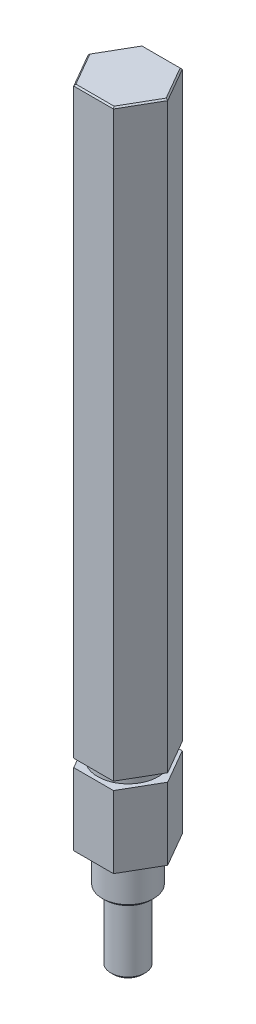
ISO-10303-21;
HEADER;
FILE_DESCRIPTION(('STEP AP214'),'2;1');
FILE_NAME('part.step','',(''),(''),'','','');
FILE_SCHEMA(('AUTOMOTIVE_DESIGN { 1 0 10303 214 1 1 1 1 }'));
ENDSEC;
DATA;
#1=APPLICATION_CONTEXT('core data for automotive mechanical design processes');
#2=APPLICATION_PROTOCOL_DEFINITION('international standard','automotive_design',2000,#1);
#3=PRODUCT_CONTEXT('',#1,'mechanical');
#4=PRODUCT('Part','Part','',(#3));
#5=PRODUCT_RELATED_PRODUCT_CATEGORY('part','',(#4));
#6=PRODUCT_DEFINITION_FORMATION('','',#4);
#7=PRODUCT_DEFINITION_CONTEXT('part definition',#1,'design');
#8=PRODUCT_DEFINITION('design','',#6,#7);
#9=PRODUCT_DEFINITION_SHAPE('','',#8);
#10=(LENGTH_UNIT() NAMED_UNIT(*) SI_UNIT(.MILLI.,.METRE.));
#11=(NAMED_UNIT(*) PLANE_ANGLE_UNIT() SI_UNIT($,.RADIAN.));
#12=(NAMED_UNIT(*) SI_UNIT($,.STERADIAN.) SOLID_ANGLE_UNIT());
#13=UNCERTAINTY_MEASURE_WITH_UNIT(LENGTH_MEASURE(1.E-05),#10,'distance_accuracy_value','');
#14=(GEOMETRIC_REPRESENTATION_CONTEXT(3) GLOBAL_UNCERTAINTY_ASSIGNED_CONTEXT((#13)) GLOBAL_UNIT_ASSIGNED_CONTEXT((#10,
#11,#12)) REPRESENTATION_CONTEXT('',''));
#15=CARTESIAN_POINT('',(0.,0.,0.));
#16=DIRECTION('',(0.,0.,1.));
#17=DIRECTION('',(1.,0.,0.));
#18=AXIS2_PLACEMENT_3D('',#15,#16,#17);
#19=CARTESIAN_POINT('',(-38.3071337161431,-45.212,-16.669011646302));
#20=DIRECTION('',(0.,1.,0.));
#21=DIRECTION('',(0.,0.,1.));
#22=AXIS2_PLACEMENT_3D('',#19,#20,#21);
#23=PLANE('',#22);
#24=CARTESIAN_POINT('',(-38.3071337161431,-45.2119999999923,-16.669011646302));
#25=DIRECTION('',(0.,1.,0.));
#26=DIRECTION('',(0.,0.,1.));
#27=AXIS2_PLACEMENT_3D('',#24,#25,#26);
#28=CIRCLE('',#27,2.65430000009029);
#29=CARTESIAN_POINT('',(-38.3071337161431,-45.2119999999923,-14.0147116462117));
#30=VERTEX_POINT('',#29);
#31=EDGE_CURVE('E21',#30,#30,#28,.T.);
#32=ORIENTED_EDGE('',*,*,#31,.F.);
#33=EDGE_LOOP('',(#32));
#34=FACE_BOUND('',#33,.T.);
#35=ADVANCED_FACE('F18',(#34),#23,.F.);
#36=CARTESIAN_POINT('',(-38.3071337161431,-44.704000000138,-16.669011646302));
#37=DIRECTION('',(0.,1.,0.));
#38=DIRECTION('',(0.,0.,1.));
#39=AXIS2_PLACEMENT_3D('',#36,#37,#38);
#40=CONICAL_SURFACE('',#39,3.16229999994458,0.785398163397448);
#41=CARTESIAN_POINT('',(-38.3071337161431,-44.704,-16.669011646302));
#42=DIRECTION('',(0.,1.,0.));
#43=DIRECTION('',(0.,0.,1.));
#44=AXIS2_PLACEMENT_3D('',#41,#42,#43);
#45=CIRCLE('',#44,3.1623);
#46=CARTESIAN_POINT('',(-38.3071337161431,-44.704,-13.506711646302));
#47=VERTEX_POINT('',#46);
#48=EDGE_CURVE('E155',#47,#47,#45,.T.);
#49=ORIENTED_EDGE('',*,*,#48,.F.);
#50=EDGE_LOOP('',(#49));
#51=FACE_BOUND('',#50,.T.);
#52=ORIENTED_EDGE('',*,*,#31,.T.);
#53=EDGE_LOOP('',(#52));
#54=FACE_BOUND('',#53,.T.);
#55=ADVANCED_FACE('F191',(#51,#54),#40,.T.);
#56=CARTESIAN_POINT('',(-38.3071337161431,-45.212,-16.669011646302));
#57=DIRECTION('',(0.,1.,0.));
#58=DIRECTION('',(0.,0.,1.));
#59=AXIS2_PLACEMENT_3D('',#56,#57,#58);
#60=CYLINDRICAL_SURFACE('',#59,3.1623);
#61=CARTESIAN_POINT('',(-38.3071337161431,-32.512,-16.669011646302));
#62=DIRECTION('',(0.,1.,0.));
#63=DIRECTION('',(0.,0.,1.));
#64=AXIS2_PLACEMENT_3D('',#61,#62,#63);
#65=CIRCLE('',#64,3.1623);
#66=CARTESIAN_POINT('',(-38.3071337161431,-32.512,-13.506711646302));
#67=VERTEX_POINT('',#66);
#68=EDGE_CURVE('E158',#67,#67,#65,.F.);
#69=ORIENTED_EDGE('',*,*,#68,.T.);
#70=EDGE_LOOP('',(#69));
#71=FACE_BOUND('',#70,.T.);
#72=ORIENTED_EDGE('',*,*,#48,.T.);
#73=EDGE_LOOP('',(#72));
#74=FACE_BOUND('',#73,.T.);
#75=ADVANCED_FACE('F175',(#71,#74),#60,.T.);
#76=CARTESIAN_POINT('',(-38.3071337161431,-32.512,-16.669011646302));
#77=DIRECTION('',(0.,1.,0.));
#78=DIRECTION('',(0.,0.,1.));
#79=AXIS2_PLACEMENT_3D('',#76,#77,#78);
#80=PLANE('',#79);
#81=CARTESIAN_POINT('',(-38.3071337161431,-32.511999999997,-16.669011646302));
#82=DIRECTION('',(0.,1.,0.));
#83=DIRECTION('',(0.,0.,1.));
#84=AXIS2_PLACEMENT_3D('',#81,#82,#83);
#85=CIRCLE('',#84,4.24179999994759);
#86=CARTESIAN_POINT('',(-38.3071337161431,-32.511999999997,-12.4272116463544));
#87=VERTEX_POINT('',#86);
#88=EDGE_CURVE('E154',#87,#87,#85,.T.);
#89=ORIENTED_EDGE('',*,*,#88,.F.);
#90=EDGE_LOOP('',(#89));
#91=FACE_BOUND('',#90,.T.);
#92=ORIENTED_EDGE('',*,*,#68,.F.);
#93=EDGE_LOOP('',(#92));
#94=FACE_BOUND('',#93,.T.);
#95=ADVANCED_FACE('F178',(#91,#94),#80,.F.);
#96=CARTESIAN_POINT('',(-38.3071337161431,-32.0039999999722,-16.669011646302));
#97=DIRECTION('',(0.,1.,0.));
#98=DIRECTION('',(0.,0.,1.));
#99=AXIS2_PLACEMENT_3D('',#96,#97,#98);
#100=CONICAL_SURFACE('',#99,4.74979999991557,0.7853981633415);
#101=CARTESIAN_POINT('',(-38.3071337161431,-32.004,-16.669011646302));
#102=DIRECTION('',(0.,1.,0.));
#103=DIRECTION('',(0.,0.,1.));
#104=AXIS2_PLACEMENT_3D('',#101,#102,#103);
#105=CIRCLE('',#104,4.7498);
#106=CARTESIAN_POINT('',(-38.3071337161431,-32.004,-11.919211646302));
#107=VERTEX_POINT('',#106);
#108=EDGE_CURVE('E151',#107,#107,#105,.T.);
#109=ORIENTED_EDGE('',*,*,#108,.F.);
#110=EDGE_LOOP('',(#109));
#111=FACE_BOUND('',#110,.T.);
#112=ORIENTED_EDGE('',*,*,#88,.T.);
#113=EDGE_LOOP('',(#112));
#114=FACE_BOUND('',#113,.T.);
#115=ADVANCED_FACE('F180',(#111,#114),#100,.T.);
#116=CARTESIAN_POINT('',(-38.3071337161431,-32.512,-16.669011646302));
#117=DIRECTION('',(0.,1.,0.));
#118=DIRECTION('',(0.,0.,1.));
#119=AXIS2_PLACEMENT_3D('',#116,#117,#118);
#120=CYLINDRICAL_SURFACE('',#119,4.7498);
#121=CARTESIAN_POINT('',(-38.3071337161431,-25.4,-16.669011646302));
#122=DIRECTION('',(0.,1.,0.));
#123=DIRECTION('',(0.,0.,1.));
#124=AXIS2_PLACEMENT_3D('',#121,#122,#123);
#125=CIRCLE('',#124,4.7498);
#126=CARTESIAN_POINT('',(-38.3071337161431,-25.4,-11.919211646302));
#127=VERTEX_POINT('',#126);
#128=EDGE_CURVE('E133',#127,#127,#125,.F.);
#129=ORIENTED_EDGE('',*,*,#128,.T.);
#130=EDGE_LOOP('',(#129));
#131=FACE_BOUND('',#130,.T.);
#132=ORIENTED_EDGE('',*,*,#108,.T.);
#133=EDGE_LOOP('',(#132));
#134=FACE_BOUND('',#133,.T.);
#135=ADVANCED_FACE('F188',(#131,#134),#120,.T.);
#136=CARTESIAN_POINT('',(-38.3071337161431,-25.4,-3.96901164630201));
#137=DIRECTION('',(0.,1.,0.));
#138=DIRECTION('',(0.,0.,1.));
#139=AXIS2_PLACEMENT_3D('',#136,#137,#138);
#140=PLANE('',#139);
#141=DIRECTION('',(-0.5,0.,0.866025403784439));
#142=VECTOR('',#141,1.);
#143=CARTESIAN_POINT('',(-41.9733079254973,-25.4,-23.019011646302));
#144=LINE('',#143,#142);
#145=CARTESIAN_POINT('',(-41.9733079254973,-25.4,-23.019011646302));
#146=VERTEX_POINT('',#145);
#147=CARTESIAN_POINT('',(-45.6394821348514,-25.4,-16.669011646302));
#148=VERTEX_POINT('',#147);
#149=EDGE_CURVE('E125',#146,#148,#144,.T.);
#150=ORIENTED_EDGE('',*,*,#149,.F.);
#151=DIRECTION('',(-1.,0.,0.));
#152=VECTOR('',#151,1.);
#153=CARTESIAN_POINT('',(-34.640959506789,-25.4,-23.019011646302));
#154=LINE('',#153,#152);
#155=CARTESIAN_POINT('',(-34.640959506789,-25.4,-23.019011646302));
#156=VERTEX_POINT('',#155);
#157=EDGE_CURVE('E122',#156,#146,#154,.T.);
#158=ORIENTED_EDGE('',*,*,#157,.F.);
#159=DIRECTION('',(-0.5,0.,-0.866025403784439));
#160=VECTOR('',#159,1.);
#161=CARTESIAN_POINT('',(-30.9747852974349,-25.4,-16.669011646302));
#162=LINE('',#161,#160);
#163=CARTESIAN_POINT('',(-30.9747852974349,-25.4,-16.669011646302));
#164=VERTEX_POINT('',#163);
#165=EDGE_CURVE('E142',#164,#156,#162,.T.);
#166=ORIENTED_EDGE('',*,*,#165,.F.);
#167=DIRECTION('',(0.500000000000001,0.,-0.866025403784438));
#168=VECTOR('',#167,1.);
#169=CARTESIAN_POINT('',(-34.640959506789,-25.4,-10.319011646302));
#170=LINE('',#169,#168);
#171=CARTESIAN_POINT('',(-34.640959506789,-25.4,-10.319011646302));
#172=VERTEX_POINT('',#171);
#173=EDGE_CURVE('E482',#172,#164,#170,.T.);
#174=ORIENTED_EDGE('',*,*,#173,.F.);
#175=DIRECTION('',(1.,0.,0.));
#176=VECTOR('',#175,1.);
#177=CARTESIAN_POINT('',(-41.9733079254973,-25.4,-10.319011646302));
#178=LINE('',#177,#176);
#179=CARTESIAN_POINT('',(-41.9733079254973,-25.4,-10.319011646302));
#180=VERTEX_POINT('',#179);
#181=EDGE_CURVE('E487',#180,#172,#178,.T.);
#182=ORIENTED_EDGE('',*,*,#181,.F.);
#183=DIRECTION('',(0.5,0.,0.866025403784439));
#184=VECTOR('',#183,1.);
#185=CARTESIAN_POINT('',(-45.6394821348514,-25.4,-16.669011646302));
#186=LINE('',#185,#184);
#187=EDGE_CURVE('E130',#148,#180,#186,.T.);
#188=ORIENTED_EDGE('',*,*,#187,.F.);
#189=EDGE_LOOP('',(#150,#158,#166,#174,#182,#188));
#190=FACE_BOUND('',#189,.T.);
#191=ORIENTED_EDGE('',*,*,#128,.F.);
#192=EDGE_LOOP('',(#191));
#193=FACE_BOUND('',#192,.T.);
#194=ADVANCED_FACE('F127',(#190,#193),#140,.F.);
#195=CARTESIAN_POINT('',(-41.9733079254973,-25.4,-23.019011646302));
#196=DIRECTION('',(-0.866025403784439,0.,-0.5));
#197=DIRECTION('',(-0.5,0.,0.866025403784439));
#198=AXIS2_PLACEMENT_3D('',#195,#196,#197);
#199=PLANE('',#198);
#200=ORIENTED_EDGE('',*,*,#149,.T.);
#201=DIRECTION('',(0.,1.,0.));
#202=VECTOR('',#201,1.);
#203=CARTESIAN_POINT('',(-45.6394821348514,-25.4,-16.669011646302));
#204=LINE('',#203,#202);
#205=CARTESIAN_POINT('',(-45.6394821348514,-12.1158,-16.669011646302));
#206=VERTEX_POINT('',#205);
#207=EDGE_CURVE('E493',#206,#148,#204,.F.);
#208=ORIENTED_EDGE('',*,*,#207,.F.);
#209=DIRECTION('',(0.5,0.,-0.866025403784439));
#210=VECTOR('',#209,1.);
#211=CARTESIAN_POINT('',(-45.6394821348514,-12.1158,-16.669011646302));
#212=LINE('',#211,#210);
#213=CARTESIAN_POINT('',(-41.9733079254973,-12.1158,-23.019011646302));
#214=VERTEX_POINT('',#213);
#215=EDGE_CURVE('E139',#206,#214,#212,.T.);
#216=ORIENTED_EDGE('',*,*,#215,.T.);
#217=DIRECTION('',(0.,1.,0.));
#218=VECTOR('',#217,1.);
#219=CARTESIAN_POINT('',(-41.9733079254973,-25.4,-23.019011646302));
#220=LINE('',#219,#218);
#221=EDGE_CURVE('E136',#146,#214,#220,.T.);
#222=ORIENTED_EDGE('',*,*,#221,.F.);
#223=EDGE_LOOP('',(#200,#208,#216,#222));
#224=FACE_BOUND('',#223,.T.);
#225=ADVANCED_FACE('F137',(#224),#199,.T.);
#226=CARTESIAN_POINT('',(-34.640959506789,-25.4,-23.019011646302));
#227=DIRECTION('',(0.,0.,-1.));
#228=DIRECTION('',(-1.,0.,0.));
#229=AXIS2_PLACEMENT_3D('',#226,#227,#228);
#230=PLANE('',#229);
#231=ORIENTED_EDGE('',*,*,#157,.T.);
#232=ORIENTED_EDGE('',*,*,#221,.T.);
#233=DIRECTION('',(1.,0.,0.));
#234=VECTOR('',#233,1.);
#235=CARTESIAN_POINT('',(-21.7881364409388,-12.1158,-23.019011646302));
#236=LINE('',#235,#234);
#237=CARTESIAN_POINT('',(-34.640959506789,-12.1158,-23.019011646302));
#238=VERTEX_POINT('',#237);
#239=EDGE_CURVE('E504',#214,#238,#236,.T.);
#240=ORIENTED_EDGE('',*,*,#239,.T.);
#241=DIRECTION('',(0.,1.,0.));
#242=VECTOR('',#241,1.);
#243=CARTESIAN_POINT('',(-34.640959506789,-25.4,-23.019011646302));
#244=LINE('',#243,#242);
#245=EDGE_CURVE('E146',#156,#238,#244,.T.);
#246=ORIENTED_EDGE('',*,*,#245,.F.);
#247=EDGE_LOOP('',(#231,#232,#240,#246));
#248=FACE_BOUND('',#247,.T.);
#249=ADVANCED_FACE('F144',(#248),#230,.T.);
#250=CARTESIAN_POINT('',(-30.9747852974349,-25.4,-16.669011646302));
#251=DIRECTION('',(0.866025403784439,0.,-0.5));
#252=DIRECTION('',(-0.5,0.,-0.866025403784439));
#253=AXIS2_PLACEMENT_3D('',#250,#251,#252);
#254=PLANE('',#253);
#255=ORIENTED_EDGE('',*,*,#165,.T.);
#256=ORIENTED_EDGE('',*,*,#245,.T.);
#257=DIRECTION('',(0.5,0.,0.866025403784438));
#258=VECTOR('',#257,1.);
#259=CARTESIAN_POINT('',(-34.640959506789,-12.1158,-23.019011646302));
#260=LINE('',#259,#258);
#261=CARTESIAN_POINT('',(-30.9747852974349,-12.1158,-16.669011646302));
#262=VERTEX_POINT('',#261);
#263=EDGE_CURVE('E506',#238,#262,#260,.T.);
#264=ORIENTED_EDGE('',*,*,#263,.T.);
#265=DIRECTION('',(0.,1.,0.));
#266=VECTOR('',#265,1.);
#267=CARTESIAN_POINT('',(-30.9747852974349,-25.4,-16.669011646302));
#268=LINE('',#267,#266);
#269=EDGE_CURVE('E480',#164,#262,#268,.T.);
#270=ORIENTED_EDGE('',*,*,#269,.F.);
#271=EDGE_LOOP('',(#255,#256,#264,#270));
#272=FACE_BOUND('',#271,.T.);
#273=ADVANCED_FACE('F272',(#272),#254,.T.);
#274=CARTESIAN_POINT('',(-34.640959506789,-25.4,-10.319011646302));
#275=DIRECTION('',(0.866025403784438,0.,0.500000000000001));
#276=DIRECTION('',(0.500000000000001,0.,-0.866025403784438));
#277=AXIS2_PLACEMENT_3D('',#274,#275,#276);
#278=PLANE('',#277);
#279=ORIENTED_EDGE('',*,*,#173,.T.);
#280=ORIENTED_EDGE('',*,*,#269,.T.);
#281=DIRECTION('',(-0.500000000000001,0.,0.866025403784438));
#282=VECTOR('',#281,1.);
#283=CARTESIAN_POINT('',(-30.9747852974349,-12.1158,-16.669011646302));
#284=LINE('',#283,#282);
#285=CARTESIAN_POINT('',(-34.640959506789,-12.1158,-10.319011646302));
#286=VERTEX_POINT('',#285);
#287=EDGE_CURVE('E508',#262,#286,#284,.T.);
#288=ORIENTED_EDGE('',*,*,#287,.T.);
#289=DIRECTION('',(0.,1.,0.));
#290=VECTOR('',#289,1.);
#291=CARTESIAN_POINT('',(-34.640959506789,-25.4,-10.319011646302));
#292=LINE('',#291,#290);
#293=EDGE_CURVE('E490',#172,#286,#292,.T.);
#294=ORIENTED_EDGE('',*,*,#293,.F.);
#295=EDGE_LOOP('',(#279,#280,#288,#294));
#296=FACE_BOUND('',#295,.T.);
#297=ADVANCED_FACE('F268',(#296),#278,.T.);
#298=CARTESIAN_POINT('',(-41.9733079254973,-25.4,-10.319011646302));
#299=DIRECTION('',(0.,0.,1.));
#300=DIRECTION('',(1.,0.,0.));
#301=AXIS2_PLACEMENT_3D('',#298,#299,#300);
#302=PLANE('',#301);
#303=ORIENTED_EDGE('',*,*,#181,.T.);
#304=ORIENTED_EDGE('',*,*,#293,.T.);
#305=DIRECTION('',(1.,0.,0.));
#306=VECTOR('',#305,1.);
#307=CARTESIAN_POINT('',(-21.7881364409388,-12.1158,-10.319011646302));
#308=LINE('',#307,#306);
#309=CARTESIAN_POINT('',(-41.9733079254973,-12.1158,-10.319011646302));
#310=VERTEX_POINT('',#309);
#311=EDGE_CURVE('E510',#286,#310,#308,.F.);
#312=ORIENTED_EDGE('',*,*,#311,.T.);
#313=DIRECTION('',(0.,1.,0.));
#314=VECTOR('',#313,1.);
#315=CARTESIAN_POINT('',(-41.9733079254973,-25.4,-10.319011646302));
#316=LINE('',#315,#314);
#317=EDGE_CURVE('E496',#180,#310,#316,.T.);
#318=ORIENTED_EDGE('',*,*,#317,.F.);
#319=EDGE_LOOP('',(#303,#304,#312,#318));
#320=FACE_BOUND('',#319,.T.);
#321=ADVANCED_FACE('F264',(#320),#302,.T.);
#322=CARTESIAN_POINT('',(-45.6394821348514,-25.4,-16.669011646302));
#323=DIRECTION('',(-0.866025403784439,0.,0.5));
#324=DIRECTION('',(0.5,0.,0.866025403784439));
#325=AXIS2_PLACEMENT_3D('',#322,#323,#324);
#326=PLANE('',#325);
#327=ORIENTED_EDGE('',*,*,#187,.T.);
#328=ORIENTED_EDGE('',*,*,#317,.T.);
#329=DIRECTION('',(-0.5,0.,-0.866025403784438));
#330=VECTOR('',#329,1.);
#331=CARTESIAN_POINT('',(-41.9733079254973,-12.1158,-10.319011646302));
#332=LINE('',#331,#330);
#333=EDGE_CURVE('E512',#310,#206,#332,.T.);
#334=ORIENTED_EDGE('',*,*,#333,.T.);
#335=ORIENTED_EDGE('',*,*,#207,.T.);
#336=EDGE_LOOP('',(#327,#328,#334,#335));
#337=FACE_BOUND('',#336,.T.);
#338=ADVANCED_FACE('F260',(#337),#326,.T.);
#339=CARTESIAN_POINT('',(-38.3071337161451,97.0813400000005,-10.573011646302));
#340=DIRECTION('',(0.,-0.707106781186544,-0.707106781186551));
#341=DIRECTION('',(0.,0.707106781186551,-0.707106781186544));
#342=AXIS2_PLACEMENT_3D('',#339,#340,#341);
#343=PLANE('',#342);
#344=DIRECTION('',(1.,0.,0.));
#345=VECTOR('',#344,1.);
#346=CARTESIAN_POINT('',(-41.9733079254973,96.8273400000005,-10.319011646302));
#347=LINE('',#346,#345);
#348=CARTESIAN_POINT('',(-34.640959506789,96.8273400000005,-10.319011646302));
#349=VERTEX_POINT('',#348);
#350=CARTESIAN_POINT('',(-41.9733079254973,96.8273400000005,-10.319011646302));
#351=VERTEX_POINT('',#350);
#352=EDGE_CURVE('E535',#349,#351,#347,.F.);
#353=ORIENTED_EDGE('',*,*,#352,.F.);
#354=DIRECTION('',(-0.377964473009223,0.654653670707976,-0.654653670707981));
#355=VECTOR('',#354,1.);
#356=CARTESIAN_POINT('',(-34.640959506789,96.8273400000005,-10.319011646302));
#357=LINE('',#356,#355);
#358=CARTESIAN_POINT('',(-34.7876064751632,97.0813400000005,-10.573011646302));
#359=VERTEX_POINT('',#358);
#360=EDGE_CURVE('E499',#349,#359,#357,.T.);
#361=ORIENTED_EDGE('',*,*,#360,.T.);
#362=DIRECTION('',(1.,0.,0.));
#363=VECTOR('',#362,1.);
#364=CARTESIAN_POINT('',(-38.3071337161451,97.0813400000005,-10.573011646302));
#365=LINE('',#364,#363);
#366=CARTESIAN_POINT('',(-41.8266609571231,97.0813400000005,-10.573011646302));
#367=VERTEX_POINT('',#366);
#368=EDGE_CURVE('E522',#367,#359,#365,.T.);
#369=ORIENTED_EDGE('',*,*,#368,.F.);
#370=DIRECTION('',(-0.377964473009255,-0.654653670707976,0.654653670707962));
#371=VECTOR('',#370,1.);
#372=CARTESIAN_POINT('',(-41.8266609571231,97.0813400000005,-10.573011646302));
#373=LINE('',#372,#371);
#374=EDGE_CURVE('E515',#367,#351,#373,.T.);
#375=ORIENTED_EDGE('',*,*,#374,.T.);
#376=EDGE_LOOP('',(#353,#361,#369,#375));
#377=FACE_BOUND('',#376,.T.);
#378=ADVANCED_FACE('F256',(#377),#343,.F.);
#379=CARTESIAN_POINT('',(-33.0278428546734,97.0813400000005,-13.6210116463016));
#380=DIRECTION('',(-0.612372435695796,-0.707106781186546,-0.353553390593275));
#381=DIRECTION('',(0.755928946018453,-0.654653670707979,0.));
#382=AXIS2_PLACEMENT_3D('',#379,#380,#381);
#383=PLANE('',#382);
#384=DIRECTION('',(0.500000000000001,0.,-0.866025403784438));
#385=VECTOR('',#384,1.);
#386=CARTESIAN_POINT('',(-34.7876064751632,97.0813400000005,-10.573011646302));
#387=LINE('',#386,#385);
#388=CARTESIAN_POINT('',(-31.2680792341832,97.0813400000005,-16.669011646302));
#389=VERTEX_POINT('',#388);
#390=EDGE_CURVE('E525',#359,#389,#387,.T.);
#391=ORIENTED_EDGE('',*,*,#390,.F.);
#392=ORIENTED_EDGE('',*,*,#360,.F.);
#393=DIRECTION('',(0.500000000000001,0.,-0.866025403784438));
#394=VECTOR('',#393,1.);
#395=CARTESIAN_POINT('',(-34.640959506789,96.8273400000005,-10.319011646302));
#396=LINE('',#395,#394);
#397=CARTESIAN_POINT('',(-30.9747852974349,96.8273400000005,-16.669011646302));
#398=VERTEX_POINT('',#397);
#399=EDGE_CURVE('E538',#398,#349,#396,.F.);
#400=ORIENTED_EDGE('',*,*,#399,.F.);
#401=DIRECTION('',(0.755928946018445,-0.654653670707988,0.));
#402=VECTOR('',#401,1.);
#403=CARTESIAN_POINT('',(-32.2736584458922,97.952197142858,-16.669011646302));
#404=LINE('',#403,#402);
#405=EDGE_CURVE('E501',#398,#389,#404,.F.);
#406=ORIENTED_EDGE('',*,*,#405,.T.);
#407=EDGE_LOOP('',(#391,#392,#400,#406));
#408=FACE_BOUND('',#407,.T.);
#409=ADVANCED_FACE('F252',(#408),#383,.F.);
#410=CARTESIAN_POINT('',(-33.0278428546739,97.0813400000005,-19.7170116463033));
#411=DIRECTION('',(-0.612372435695803,-0.707106781186538,0.353553390593279));
#412=DIRECTION('',(0.755928946018445,-0.654653670707988,0.));
#413=AXIS2_PLACEMENT_3D('',#410,#411,#412);
#414=PLANE('',#413);
#415=DIRECTION('',(-0.5,0.,-0.866025403784439));
#416=VECTOR('',#415,1.);
#417=CARTESIAN_POINT('',(-31.2680792341832,97.0813400000005,-16.669011646302));
#418=LINE('',#417,#416);
#419=CARTESIAN_POINT('',(-34.7876064751632,97.0813400000005,-22.765011646302));
#420=VERTEX_POINT('',#419);
#421=EDGE_CURVE('E528',#389,#420,#418,.T.);
#422=ORIENTED_EDGE('',*,*,#421,.F.);
#423=ORIENTED_EDGE('',*,*,#405,.F.);
#424=DIRECTION('',(-0.5,0.,-0.866025403784439));
#425=VECTOR('',#424,1.);
#426=CARTESIAN_POINT('',(-30.9747852974349,96.8273400000005,-16.669011646302));
#427=LINE('',#426,#425);
#428=CARTESIAN_POINT('',(-34.640959506789,96.8273400000005,-23.019011646302));
#429=VERTEX_POINT('',#428);
#430=EDGE_CURVE('E544',#429,#398,#427,.F.);
#431=ORIENTED_EDGE('',*,*,#430,.F.);
#432=DIRECTION('',(-0.377964473009211,0.654653670707982,0.654653670707982));
#433=VECTOR('',#432,1.);
#434=CARTESIAN_POINT('',(-34.640959506789,96.8273400000005,-23.019011646302));
#435=LINE('',#434,#433);
#436=EDGE_CURVE('E532',#429,#420,#435,.T.);
#437=ORIENTED_EDGE('',*,*,#436,.T.);
#438=EDGE_LOOP('',(#422,#423,#431,#437));
#439=FACE_BOUND('',#438,.T.);
#440=ADVANCED_FACE('F248',(#439),#414,.F.);
#441=CARTESIAN_POINT('',(-21.7881364409388,-12.1158,-16.669011646302));
#442=DIRECTION('',(0.,-1.,0.));
#443=DIRECTION('',(0.,0.,-1.));
#444=AXIS2_PLACEMENT_3D('',#441,#442,#443);
#445=PLANE('',#444);
#446=ORIENTED_EDGE('',*,*,#311,.F.);
#447=ORIENTED_EDGE('',*,*,#287,.F.);
#448=ORIENTED_EDGE('',*,*,#263,.F.);
#449=ORIENTED_EDGE('',*,*,#239,.F.);
#450=ORIENTED_EDGE('',*,*,#215,.F.);
#451=ORIENTED_EDGE('',*,*,#333,.F.);
#452=EDGE_LOOP('',(#446,#447,#448,#449,#450,#451));
#453=FACE_BOUND('',#452,.T.);
#454=CARTESIAN_POINT('',(-38.3071337161431,-12.1158,-16.669011646302));
#455=DIRECTION('',(0.,1.,0.));
#456=DIRECTION('',(0.,0.,1.));
#457=AXIS2_PLACEMENT_3D('',#454,#455,#456);
#458=CIRCLE('',#457,5.58800000000003);
#459=CARTESIAN_POINT('',(-38.3071337161431,-12.1158,-11.081011646302));
#460=VERTEX_POINT('',#459);
#461=EDGE_CURVE('E164',#460,#460,#458,.T.);
#462=ORIENTED_EDGE('',*,*,#461,.F.);
#463=EDGE_LOOP('',(#462));
#464=FACE_BOUND('',#463,.T.);
#465=ADVANCED_FACE('F244',(#453,#464),#445,.F.);
#466=CARTESIAN_POINT('',(-43.5864245776138,97.0813400000005,-13.6210116463033));
#467=DIRECTION('',(0.612372435695786,-0.707106781186557,-0.353553390593269));
#468=DIRECTION('',(0.755928946018463,0.654653670707967,0.));
#469=AXIS2_PLACEMENT_3D('',#466,#467,#468);
#470=PLANE('',#469);
#471=DIRECTION('',(0.5,0.,0.866025403784439));
#472=VECTOR('',#471,1.);
#473=CARTESIAN_POINT('',(-45.6394821348514,96.8273400000005,-16.669011646302));
#474=LINE('',#473,#472);
#475=CARTESIAN_POINT('',(-45.6394821348514,96.8273400000005,-16.669011646302));
#476=VERTEX_POINT('',#475);
#477=EDGE_CURVE('E551',#351,#476,#474,.F.);
#478=ORIENTED_EDGE('',*,*,#477,.F.);
#479=ORIENTED_EDGE('',*,*,#374,.F.);
#480=DIRECTION('',(0.5,0.,0.866025403784439));
#481=VECTOR('',#480,1.);
#482=CARTESIAN_POINT('',(-45.3461881981031,97.0813400000005,-16.669011646302));
#483=LINE('',#482,#481);
#484=CARTESIAN_POINT('',(-45.346188198103,97.0813400000005,-16.669011646302));
#485=VERTEX_POINT('',#484);
#486=EDGE_CURVE('E519',#485,#367,#483,.T.);
#487=ORIENTED_EDGE('',*,*,#486,.F.);
#488=DIRECTION('',(0.755928946018463,0.654653670707967,0.));
#489=VECTOR('',#488,1.);
#490=CARTESIAN_POINT('',(-44.3406089863949,97.9521971428572,-16.669011646302));
#491=LINE('',#490,#489);
#492=EDGE_CURVE('E517',#476,#485,#491,.T.);
#493=ORIENTED_EDGE('',*,*,#492,.F.);
#494=EDGE_LOOP('',(#478,#479,#487,#493));
#495=FACE_BOUND('',#494,.T.);
#496=ADVANCED_FACE('F240',(#495),#470,.F.);
#497=CARTESIAN_POINT('',(-38.3071337161451,97.0813400000005,-16.6690116463026));
#498=DIRECTION('',(0.,1.,0.));
#499=DIRECTION('',(0.,0.,1.));
#500=AXIS2_PLACEMENT_3D('',#497,#498,#499);
#501=PLANE('',#500);
#502=DIRECTION('',(1.,0.,0.));
#503=VECTOR('',#502,1.);
#504=CARTESIAN_POINT('',(-38.3071337161451,97.0813400000005,-22.765011646302));
#505=LINE('',#504,#503);
#506=CARTESIAN_POINT('',(-41.8266609571231,97.0813400000005,-22.765011646302));
#507=VERTEX_POINT('',#506);
#508=EDGE_CURVE('E530',#420,#507,#505,.F.);
#509=ORIENTED_EDGE('',*,*,#508,.T.);
#510=DIRECTION('',(-0.500000000000001,0.,0.866025403784438));
#511=VECTOR('',#510,1.);
#512=CARTESIAN_POINT('',(-41.8266609571231,97.0813400000005,-22.765011646302));
#513=LINE('',#512,#511);
#514=EDGE_CURVE('E554',#507,#485,#513,.T.);
#515=ORIENTED_EDGE('',*,*,#514,.T.);
#516=ORIENTED_EDGE('',*,*,#486,.T.);
#517=ORIENTED_EDGE('',*,*,#368,.T.);
#518=ORIENTED_EDGE('',*,*,#390,.T.);
#519=ORIENTED_EDGE('',*,*,#421,.T.);
#520=EDGE_LOOP('',(#509,#515,#516,#517,#518,#519));
#521=FACE_BOUND('',#520,.T.);
#522=ADVANCED_FACE('F236',(#521),#501,.T.);
#523=CARTESIAN_POINT('',(-38.3071337161451,97.0813400000005,-22.765011646302));
#524=DIRECTION('',(0.,-0.707106781186551,0.707106781186544));
#525=DIRECTION('',(0.,-0.707106781186544,-0.707106781186551));
#526=AXIS2_PLACEMENT_3D('',#523,#524,#525);
#527=PLANE('',#526);
#528=DIRECTION('',(-1.,0.,0.));
#529=VECTOR('',#528,1.);
#530=CARTESIAN_POINT('',(-34.640959506789,96.8273400000005,-23.019011646302));
#531=LINE('',#530,#529);
#532=CARTESIAN_POINT('',(-41.9733079254973,96.8273400000005,-23.019011646302));
#533=VERTEX_POINT('',#532);
#534=EDGE_CURVE('E560',#533,#429,#531,.F.);
#535=ORIENTED_EDGE('',*,*,#534,.F.);
#536=DIRECTION('',(0.377964473009259,0.654653670707977,0.654653670707959));
#537=VECTOR('',#536,1.);
#538=CARTESIAN_POINT('',(-41.9733079254973,96.8273400000005,-23.019011646302));
#539=LINE('',#538,#537);
#540=EDGE_CURVE('E557',#533,#507,#539,.T.);
#541=ORIENTED_EDGE('',*,*,#540,.T.);
#542=ORIENTED_EDGE('',*,*,#508,.F.);
#543=ORIENTED_EDGE('',*,*,#436,.F.);
#544=EDGE_LOOP('',(#535,#541,#542,#543));
#545=FACE_BOUND('',#544,.T.);
#546=ADVANCED_FACE('F232',(#545),#527,.F.);
#547=CARTESIAN_POINT('',(-41.9733079254973,-25.4,-10.319011646302));
#548=DIRECTION('',(0.,0.,1.));
#549=DIRECTION('',(1.,0.,0.));
#550=AXIS2_PLACEMENT_3D('',#547,#548,#549);
#551=PLANE('',#550);
#552=DIRECTION('',(0.,1.,0.));
#553=VECTOR('',#552,1.);
#554=CARTESIAN_POINT('',(-41.9733079254973,-25.4,-10.319011646302));
#555=LINE('',#554,#553);
#556=CARTESIAN_POINT('',(-41.9733079254973,-10.6172,-10.319011646302));
#557=VERTEX_POINT('',#556);
#558=EDGE_CURVE('E167',#557,#351,#555,.T.);
#559=ORIENTED_EDGE('',*,*,#558,.F.);
#560=DIRECTION('',(1.,0.,0.));
#561=VECTOR('',#560,1.);
#562=CARTESIAN_POINT('',(-32.7191337161431,-10.6172,-10.319011646302));
#563=LINE('',#562,#561);
#564=CARTESIAN_POINT('',(-34.640959506789,-10.6172,-10.319011646302));
#565=VERTEX_POINT('',#564);
#566=EDGE_CURVE('E569',#557,#565,#563,.T.);
#567=ORIENTED_EDGE('',*,*,#566,.T.);
#568=DIRECTION('',(0.,1.,0.));
#569=VECTOR('',#568,1.);
#570=CARTESIAN_POINT('',(-34.640959506789,-25.4,-10.319011646302));
#571=LINE('',#570,#569);
#572=EDGE_CURVE('E541',#349,#565,#571,.F.);
#573=ORIENTED_EDGE('',*,*,#572,.F.);
#574=ORIENTED_EDGE('',*,*,#352,.T.);
#575=EDGE_LOOP('',(#559,#567,#573,#574));
#576=FACE_BOUND('',#575,.T.);
#577=ADVANCED_FACE('F228',(#576),#551,.T.);
#578=CARTESIAN_POINT('',(-34.640959506789,-25.4,-10.319011646302));
#579=DIRECTION('',(0.866025403784438,0.,0.500000000000001));
#580=DIRECTION('',(0.500000000000001,0.,-0.866025403784438));
#581=AXIS2_PLACEMENT_3D('',#578,#579,#580);
#582=PLANE('',#581);
#583=ORIENTED_EDGE('',*,*,#572,.T.);
#584=DIRECTION('',(0.500000000000001,0.,-0.866025403784438));
#585=VECTOR('',#584,1.);
#586=CARTESIAN_POINT('',(-34.640959506789,-10.6172,-10.319011646302));
#587=LINE('',#586,#585);
#588=CARTESIAN_POINT('',(-30.9747852974349,-10.6172,-16.669011646302));
#589=VERTEX_POINT('',#588);
#590=EDGE_CURVE('E571',#565,#589,#587,.T.);
#591=ORIENTED_EDGE('',*,*,#590,.T.);
#592=DIRECTION('',(0.,1.,0.));
#593=VECTOR('',#592,1.);
#594=CARTESIAN_POINT('',(-30.9747852974349,-25.4,-16.669011646302));
#595=LINE('',#594,#593);
#596=EDGE_CURVE('E168',#398,#589,#595,.F.);
#597=ORIENTED_EDGE('',*,*,#596,.F.);
#598=ORIENTED_EDGE('',*,*,#399,.T.);
#599=EDGE_LOOP('',(#583,#591,#597,#598));
#600=FACE_BOUND('',#599,.T.);
#601=ADVANCED_FACE('F224',(#600),#582,.T.);
#602=CARTESIAN_POINT('',(-30.9747852974349,-25.4,-16.669011646302));
#603=DIRECTION('',(0.866025403784439,0.,-0.5));
#604=DIRECTION('',(-0.5,0.,-0.866025403784439));
#605=AXIS2_PLACEMENT_3D('',#602,#603,#604);
#606=PLANE('',#605);
#607=ORIENTED_EDGE('',*,*,#596,.T.);
#608=DIRECTION('',(-0.5,0.,-0.866025403784438));
#609=VECTOR('',#608,1.);
#610=CARTESIAN_POINT('',(-30.9747852974349,-10.6172,-16.669011646302));
#611=LINE('',#610,#609);
#612=CARTESIAN_POINT('',(-34.640959506789,-10.6172,-23.019011646302));
#613=VERTEX_POINT('',#612);
#614=EDGE_CURVE('E163',#589,#613,#611,.T.);
#615=ORIENTED_EDGE('',*,*,#614,.T.);
#616=DIRECTION('',(0.,1.,0.));
#617=VECTOR('',#616,1.);
#618=CARTESIAN_POINT('',(-34.640959506789,-25.4,-23.019011646302));
#619=LINE('',#618,#617);
#620=EDGE_CURVE('E563',#429,#613,#619,.F.);
#621=ORIENTED_EDGE('',*,*,#620,.F.);
#622=ORIENTED_EDGE('',*,*,#430,.T.);
#623=EDGE_LOOP('',(#607,#615,#621,#622));
#624=FACE_BOUND('',#623,.T.);
#625=ADVANCED_FACE('F220',(#624),#606,.T.);
#626=CARTESIAN_POINT('',(-38.3071337161431,-25.4,-16.669011646302));
#627=DIRECTION('',(0.,1.,0.));
#628=DIRECTION('',(0.,0.,1.));
#629=AXIS2_PLACEMENT_3D('',#626,#627,#628);
#630=CYLINDRICAL_SURFACE('',#629,5.58800000000003);
#631=CARTESIAN_POINT('',(-38.3071337161431,-10.6172,-16.669011646302));
#632=DIRECTION('',(0.,1.,0.));
#633=DIRECTION('',(0.,0.,1.));
#634=AXIS2_PLACEMENT_3D('',#631,#632,#633);
#635=CIRCLE('',#634,5.58800000000003);
#636=CARTESIAN_POINT('',(-38.3071337161431,-10.6172,-11.081011646302));
#637=VERTEX_POINT('',#636);
#638=EDGE_CURVE('E159',#637,#637,#635,.F.);
#639=ORIENTED_EDGE('',*,*,#638,.T.);
#640=EDGE_LOOP('',(#639));
#641=FACE_BOUND('',#640,.T.);
#642=ORIENTED_EDGE('',*,*,#461,.T.);
#643=EDGE_LOOP('',(#642));
#644=FACE_BOUND('',#643,.T.);
#645=ADVANCED_FACE('F216',(#641,#644),#630,.T.);
#646=CARTESIAN_POINT('',(-45.6394821348514,-25.4,-16.669011646302));
#647=DIRECTION('',(-0.866025403784439,0.,0.5));
#648=DIRECTION('',(0.5,0.,0.866025403784439));
#649=AXIS2_PLACEMENT_3D('',#646,#647,#648);
#650=PLANE('',#649);
#651=DIRECTION('',(0.,1.,0.));
#652=VECTOR('',#651,1.);
#653=CARTESIAN_POINT('',(-45.6394821348514,-25.4,-16.669011646302));
#654=LINE('',#653,#652);
#655=CARTESIAN_POINT('',(-45.6394821348514,-10.6172,-16.669011646302));
#656=VERTEX_POINT('',#655);
#657=EDGE_CURVE('E162',#656,#476,#654,.T.);
#658=ORIENTED_EDGE('',*,*,#657,.F.);
#659=DIRECTION('',(0.5,0.,0.866025403784438));
#660=VECTOR('',#659,1.);
#661=CARTESIAN_POINT('',(-45.6394821348514,-10.6172,-16.669011646302));
#662=LINE('',#661,#660);
#663=EDGE_CURVE('E566',#656,#557,#662,.T.);
#664=ORIENTED_EDGE('',*,*,#663,.T.);
#665=ORIENTED_EDGE('',*,*,#558,.T.);
#666=ORIENTED_EDGE('',*,*,#477,.T.);
#667=EDGE_LOOP('',(#658,#664,#665,#666));
#668=FACE_BOUND('',#667,.T.);
#669=ADVANCED_FACE('F212',(#668),#650,.T.);
#670=CARTESIAN_POINT('',(-43.5864245776133,97.0813400000005,-19.7170116463016));
#671=DIRECTION('',(0.612372435695792,-0.70710678118655,0.353553390593273));
#672=DIRECTION('',(0.755928946018457,0.654653670707975,0.));
#673=AXIS2_PLACEMENT_3D('',#670,#671,#672);
#674=PLANE('',#673);
#675=DIRECTION('',(-0.5,0.,0.866025403784439));
#676=VECTOR('',#675,1.);
#677=CARTESIAN_POINT('',(-41.9733079254973,96.8273400000005,-23.019011646302));
#678=LINE('',#677,#676);
#679=EDGE_CURVE('E577',#476,#533,#678,.F.);
#680=ORIENTED_EDGE('',*,*,#679,.F.);
#681=ORIENTED_EDGE('',*,*,#492,.T.);
#682=ORIENTED_EDGE('',*,*,#514,.F.);
#683=ORIENTED_EDGE('',*,*,#540,.F.);
#684=EDGE_LOOP('',(#680,#681,#682,#683));
#685=FACE_BOUND('',#684,.T.);
#686=ADVANCED_FACE('F209',(#685),#674,.F.);
#687=CARTESIAN_POINT('',(-34.640959506789,-25.4,-23.019011646302));
#688=DIRECTION('',(0.,0.,-1.));
#689=DIRECTION('',(-1.,0.,0.));
#690=AXIS2_PLACEMENT_3D('',#687,#688,#689);
#691=PLANE('',#690);
#692=ORIENTED_EDGE('',*,*,#620,.T.);
#693=DIRECTION('',(1.,0.,0.));
#694=VECTOR('',#693,1.);
#695=CARTESIAN_POINT('',(-32.7191337161431,-10.6172,-23.019011646302));
#696=LINE('',#695,#694);
#697=CARTESIAN_POINT('',(-41.9733079254973,-10.6172,-23.019011646302));
#698=VERTEX_POINT('',#697);
#699=EDGE_CURVE('E36',#613,#698,#696,.F.);
#700=ORIENTED_EDGE('',*,*,#699,.T.);
#701=DIRECTION('',(0.,1.,0.));
#702=VECTOR('',#701,1.);
#703=CARTESIAN_POINT('',(-41.9733079254973,-25.4,-23.019011646302));
#704=LINE('',#703,#702);
#705=EDGE_CURVE('E27',#533,#698,#704,.F.);
#706=ORIENTED_EDGE('',*,*,#705,.F.);
#707=ORIENTED_EDGE('',*,*,#534,.T.);
#708=EDGE_LOOP('',(#692,#700,#706,#707));
#709=FACE_BOUND('',#708,.T.);
#710=ADVANCED_FACE('F202',(#709),#691,.T.);
#711=CARTESIAN_POINT('',(-32.7191337161431,-10.6172,-16.669011646302));
#712=DIRECTION('',(0.,1.,0.));
#713=DIRECTION('',(0.,0.,1.));
#714=AXIS2_PLACEMENT_3D('',#711,#712,#713);
#715=PLANE('',#714);
#716=ORIENTED_EDGE('',*,*,#638,.F.);
#717=EDGE_LOOP('',(#716));
#718=FACE_BOUND('',#717,.T.);
#719=ORIENTED_EDGE('',*,*,#590,.F.);
#720=ORIENTED_EDGE('',*,*,#566,.F.);
#721=ORIENTED_EDGE('',*,*,#663,.F.);
#722=DIRECTION('',(-0.5,0.,0.866025403784439));
#723=VECTOR('',#722,1.);
#724=CARTESIAN_POINT('',(-41.9733079254973,-10.6172,-23.019011646302));
#725=LINE('',#724,#723);
#726=EDGE_CURVE('E11',#698,#656,#725,.T.);
#727=ORIENTED_EDGE('',*,*,#726,.F.);
#728=ORIENTED_EDGE('',*,*,#699,.F.);
#729=ORIENTED_EDGE('',*,*,#614,.F.);
#730=EDGE_LOOP('',(#719,#720,#721,#727,#728,#729));
#731=FACE_BOUND('',#730,.T.);
#732=ADVANCED_FACE('F196',(#718,#731),#715,.F.);
#733=CARTESIAN_POINT('',(-41.9733079254973,-25.4,-23.019011646302));
#734=DIRECTION('',(-0.866025403784439,0.,-0.5));
#735=DIRECTION('',(-0.5,0.,0.866025403784439));
#736=AXIS2_PLACEMENT_3D('',#733,#734,#735);
#737=PLANE('',#736);
#738=ORIENTED_EDGE('',*,*,#705,.T.);
#739=ORIENTED_EDGE('',*,*,#726,.T.);
#740=ORIENTED_EDGE('',*,*,#657,.T.);
#741=ORIENTED_EDGE('',*,*,#679,.T.);
#742=EDGE_LOOP('',(#738,#739,#740,#741));
#743=FACE_BOUND('',#742,.T.);
#744=ADVANCED_FACE('F194',(#743),#737,.T.);
#745=CLOSED_SHELL('',(#35,#55,#75,#95,#115,#135,#194,#225,#249,#273,#297,#321,#338,#378,#409,
#440,#465,#496,#522,#546,#577,#601,#625,#645,#669,#686,#710,#732,#744));
#746=MANIFOLD_SOLID_BREP('B1',#745);
#747=ADVANCED_BREP_SHAPE_REPRESENTATION('',(#18,#746),#14);
#748=SHAPE_DEFINITION_REPRESENTATION(#9,#747);
ENDSEC;
END-ISO-10303-21;
